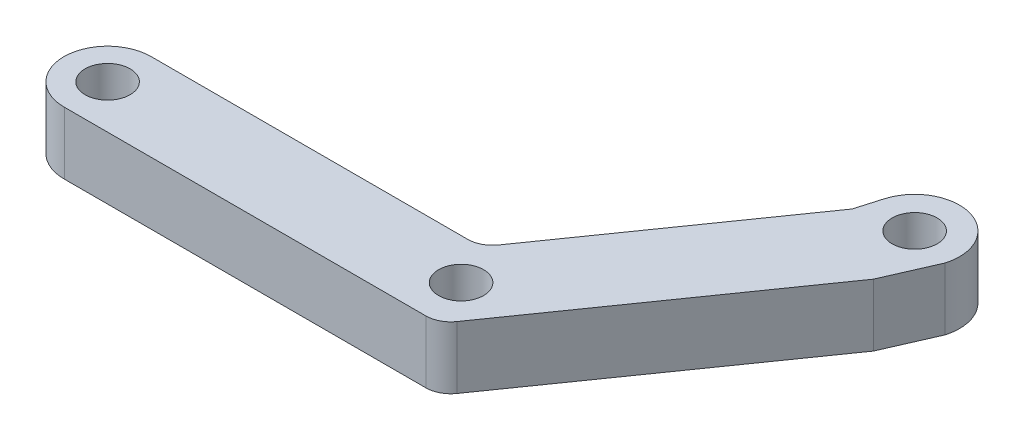
ISO-10303-21;
HEADER;
FILE_DESCRIPTION(('STEP AP214'),'2;1');
FILE_NAME('part.step','',(''),(''),'','','');
FILE_SCHEMA(('AUTOMOTIVE_DESIGN { 1 0 10303 214 1 1 1 1 }'));
ENDSEC;
DATA;
#1=APPLICATION_CONTEXT('core data for automotive mechanical design processes');
#2=APPLICATION_PROTOCOL_DEFINITION('international standard','automotive_design',2000,#1);
#3=PRODUCT_CONTEXT('',#1,'mechanical');
#4=PRODUCT('Part','Part','',(#3));
#5=PRODUCT_RELATED_PRODUCT_CATEGORY('part','',(#4));
#6=PRODUCT_DEFINITION_FORMATION('','',#4);
#7=PRODUCT_DEFINITION_CONTEXT('part definition',#1,'design');
#8=PRODUCT_DEFINITION('design','',#6,#7);
#9=PRODUCT_DEFINITION_SHAPE('','',#8);
#10=(LENGTH_UNIT() NAMED_UNIT(*) SI_UNIT(.MILLI.,.METRE.));
#11=(NAMED_UNIT(*) PLANE_ANGLE_UNIT() SI_UNIT($,.RADIAN.));
#12=(NAMED_UNIT(*) SI_UNIT($,.STERADIAN.) SOLID_ANGLE_UNIT());
#13=UNCERTAINTY_MEASURE_WITH_UNIT(LENGTH_MEASURE(1.E-05),#10,'distance_accuracy_value','');
#14=(GEOMETRIC_REPRESENTATION_CONTEXT(3) GLOBAL_UNCERTAINTY_ASSIGNED_CONTEXT((#13)) GLOBAL_UNIT_ASSIGNED_CONTEXT((#10,
#11,#12)) REPRESENTATION_CONTEXT('',''));
#15=CARTESIAN_POINT('',(0.,0.,0.));
#16=DIRECTION('',(0.,0.,1.));
#17=DIRECTION('',(1.,0.,0.));
#18=AXIS2_PLACEMENT_3D('',#15,#16,#17);
#19=CARTESIAN_POINT('',(0.,6.35,0.));
#20=DIRECTION('',(0.,1.,0.));
#21=DIRECTION('',(0.,0.,1.));
#22=AXIS2_PLACEMENT_3D('',#19,#20,#21);
#23=PLANE('',#22);
#24=CARTESIAN_POINT('',(54.2828781838694,6.35,-27.9654174211772));
#25=DIRECTION('',(0.,1.,0.));
#26=DIRECTION('',(0.,0.,1.));
#27=AXIS2_PLACEMENT_3D('',#24,#25,#26);
#28=CIRCLE('',#27,2.29235);
#29=CARTESIAN_POINT('',(54.2828781838694,6.35,-25.6730674211772));
#30=VERTEX_POINT('',#29);
#31=EDGE_CURVE('E212',#30,#30,#28,.T.);
#32=ORIENTED_EDGE('',*,*,#31,.F.);
#33=EDGE_LOOP('',(#32));
#34=FACE_BOUND('',#33,.T.);
#35=CARTESIAN_POINT('',(0.,6.35,0.));
#36=DIRECTION('',(0.,1.,0.));
#37=DIRECTION('',(0.,0.,1.));
#38=AXIS2_PLACEMENT_3D('',#35,#36,#37);
#39=CIRCLE('',#38,4.4452616227754);
#40=CARTESIAN_POINT('',(0.048227532798311,6.35,-4.445));
#41=VERTEX_POINT('',#40);
#42=CARTESIAN_POINT('',(0.048227532798311,6.35,4.445));
#43=VERTEX_POINT('',#42);
#44=EDGE_CURVE('E161',#41,#43,#39,.T.);
#45=ORIENTED_EDGE('',*,*,#44,.T.);
#46=DIRECTION('',(1.,0.,0.));
#47=VECTOR('',#46,1.);
#48=CARTESIAN_POINT('',(0.048227532798311,6.35,4.445));
#49=LINE('',#48,#47);
#50=CARTESIAN_POINT('',(36.8782275327983,6.35,4.445));
#51=VERTEX_POINT('',#50);
#52=EDGE_CURVE('E99',#43,#51,#49,.T.);
#53=ORIENTED_EDGE('',*,*,#52,.T.);
#54=CARTESIAN_POINT('',(36.8782275327983,6.35,1.90500000000002));
#55=DIRECTION('',(0.,1.,0.));
#56=DIRECTION('',(0.,0.,1.));
#57=AXIS2_PLACEMENT_3D('',#54,#55,#56);
#58=CIRCLE('',#57,2.53999999999998);
#59=CARTESIAN_POINT('',(38.9588737252923,6.35,3.36188414833166));
#60=VERTEX_POINT('',#59);
#61=EDGE_CURVE('E182',#51,#60,#58,.T.);
#62=ORIENTED_EDGE('',*,*,#61,.T.);
#63=DIRECTION('',(0.573576436351044,0.,-0.819152044288993));
#64=VECTOR('',#63,1.);
#65=CARTESIAN_POINT('',(38.9588737252923,6.35,3.36188414833166));
#66=LINE('',#65,#64);
#67=CARTESIAN_POINT('',(56.4414835052722,6.35,-21.6058701615968));
#68=VERTEX_POINT('',#67);
#69=EDGE_CURVE('E201',#60,#68,#66,.T.);
#70=ORIENTED_EDGE('',*,*,#69,.T.);
#71=DIRECTION('',(0.400949598152243,0.,-0.916100114475244));
#72=VECTOR('',#71,1.);
#73=CARTESIAN_POINT('',(56.4414835052722,6.35,-21.6058701615968));
#74=LINE('',#73,#72);
#75=CARTESIAN_POINT('',(58.6648474438086,6.35,-26.6858701615968));
#76=VERTEX_POINT('',#75);
#77=EDGE_CURVE('E198',#68,#76,#74,.T.);
#78=ORIENTED_EDGE('',*,*,#77,.T.);
#79=CARTESIAN_POINT('',(54.2828781838694,6.35,-27.9654174211772));
#80=DIRECTION('',(0.,1.,0.));
#81=DIRECTION('',(0.,0.,-1.));
#82=AXIS2_PLACEMENT_3D('',#79,#80,#81);
#83=CIRCLE('',#82,4.56496394121047);
#84=CARTESIAN_POINT('',(49.9009089239302,6.35,-29.2449646807576));
#85=VERTEX_POINT('',#84);
#86=EDGE_CURVE('E200',#76,#85,#83,.T.);
#87=ORIENTED_EDGE('',*,*,#86,.T.);
#88=DIRECTION('',(-0.280297342116838,0.,0.959913225246031));
#89=VECTOR('',#88,1.);
#90=CARTESIAN_POINT('',(49.159221831543,6.35,-26.7049646807576));
#91=LINE('',#90,#89);
#92=CARTESIAN_POINT('',(49.159221831543,6.35,-26.7049646807576));
#93=VERTEX_POINT('',#92);
#94=EDGE_CURVE('E124',#85,#93,#91,.T.);
#95=ORIENTED_EDGE('',*,*,#94,.T.);
#96=DIRECTION('',(-0.573576436351044,0.,0.819152044288993));
#97=VECTOR('',#96,1.);
#98=CARTESIAN_POINT('',(34.3310326458873,6.35,-5.52811585166835));
#99=LINE('',#98,#97);
#100=CARTESIAN_POINT('',(34.3310326458873,6.35,-5.52811585166835));
#101=VERTEX_POINT('',#100);
#102=EDGE_CURVE('E118',#93,#101,#99,.T.);
#103=ORIENTED_EDGE('',*,*,#102,.T.);
#104=CARTESIAN_POINT('',(32.2503864533933,6.35,-6.985));
#105=DIRECTION('',(0.,-1.,0.));
#106=DIRECTION('',(0.,0.,1.));
#107=AXIS2_PLACEMENT_3D('',#104,#105,#106);
#108=CIRCLE('',#107,2.54);
#109=CARTESIAN_POINT('',(32.2503864533933,6.35,-4.445));
#110=VERTEX_POINT('',#109);
#111=EDGE_CURVE('E122',#101,#110,#108,.T.);
#112=ORIENTED_EDGE('',*,*,#111,.T.);
#113=DIRECTION('',(-1.,0.,0.));
#114=VECTOR('',#113,1.);
#115=CARTESIAN_POINT('',(0.048227532798311,6.35,-4.445));
#116=LINE('',#115,#114);
#117=EDGE_CURVE('E50',#110,#41,#116,.T.);
#118=ORIENTED_EDGE('',*,*,#117,.T.);
#119=EDGE_LOOP('',(#45,#53,#62,#70,#78,#87,#95,#103,#112,#118));
#120=FACE_BOUND('',#119,.T.);
#121=CARTESIAN_POINT('',(35.7371484707128,6.35,-0.286992483727307));
#122=DIRECTION('',(0.,1.,0.));
#123=DIRECTION('',(0.,0.,1.));
#124=AXIS2_PLACEMENT_3D('',#121,#122,#123);
#125=CIRCLE('',#124,2.29235);
#126=CARTESIAN_POINT('',(35.7371484707128,6.35,2.00535751627269));
#127=VERTEX_POINT('',#126);
#128=EDGE_CURVE('E146',#127,#127,#125,.T.);
#129=ORIENTED_EDGE('',*,*,#128,.F.);
#130=EDGE_LOOP('',(#129));
#131=FACE_BOUND('',#130,.T.);
#132=CARTESIAN_POINT('',(0.,6.35,0.));
#133=DIRECTION('',(0.,1.,0.));
#134=DIRECTION('',(0.,0.,1.));
#135=AXIS2_PLACEMENT_3D('',#132,#133,#134);
#136=CIRCLE('',#135,2.29235);
#137=CARTESIAN_POINT('',(0.,6.35,2.29235));
#138=VERTEX_POINT('',#137);
#139=EDGE_CURVE('E218',#138,#138,#136,.T.);
#140=ORIENTED_EDGE('',*,*,#139,.F.);
#141=EDGE_LOOP('',(#140));
#142=FACE_BOUND('',#141,.T.);
#143=ADVANCED_FACE('F33',(#34,#120,#131,#142),#23,.T.);
#144=CARTESIAN_POINT('',(0.,0.,0.));
#145=DIRECTION('',(0.,1.,0.));
#146=DIRECTION('',(0.,0.,1.));
#147=AXIS2_PLACEMENT_3D('',#144,#145,#146);
#148=PLANE('',#147);
#149=CARTESIAN_POINT('',(0.,0.,0.));
#150=DIRECTION('',(0.,1.,0.));
#151=DIRECTION('',(0.,0.,1.));
#152=AXIS2_PLACEMENT_3D('',#149,#150,#151);
#153=CIRCLE('',#152,4.4452616227754);
#154=CARTESIAN_POINT('',(0.048227532798311,0.,-4.445));
#155=VERTEX_POINT('',#154);
#156=CARTESIAN_POINT('',(0.048227532798311,0.,4.445));
#157=VERTEX_POINT('',#156);
#158=EDGE_CURVE('E142',#155,#157,#153,.T.);
#159=ORIENTED_EDGE('',*,*,#158,.F.);
#160=DIRECTION('',(-1.,0.,0.));
#161=VECTOR('',#160,1.);
#162=CARTESIAN_POINT('',(0.048227532798311,0.,-4.445));
#163=LINE('',#162,#161);
#164=CARTESIAN_POINT('',(32.2503864533933,0.,-4.445));
#165=VERTEX_POINT('',#164);
#166=EDGE_CURVE('E91',#165,#155,#163,.T.);
#167=ORIENTED_EDGE('',*,*,#166,.F.);
#168=CARTESIAN_POINT('',(32.2503864533933,0.,-6.985));
#169=DIRECTION('',(0.,-1.,0.));
#170=DIRECTION('',(0.,0.,1.));
#171=AXIS2_PLACEMENT_3D('',#168,#169,#170);
#172=CIRCLE('',#171,2.54);
#173=CARTESIAN_POINT('',(34.3310326458873,0.,-5.52811585166835));
#174=VERTEX_POINT('',#173);
#175=EDGE_CURVE('E85',#174,#165,#172,.T.);
#176=ORIENTED_EDGE('',*,*,#175,.F.);
#177=DIRECTION('',(-0.573576436351044,0.,0.819152044288993));
#178=VECTOR('',#177,1.);
#179=CARTESIAN_POINT('',(34.3310326458873,0.,-5.52811585166835));
#180=LINE('',#179,#178);
#181=CARTESIAN_POINT('',(49.159221831543,0.,-26.7049646807576));
#182=VERTEX_POINT('',#181);
#183=EDGE_CURVE('E132',#182,#174,#180,.T.);
#184=ORIENTED_EDGE('',*,*,#183,.F.);
#185=DIRECTION('',(-0.280297342116838,0.,0.959913225246031));
#186=VECTOR('',#185,1.);
#187=CARTESIAN_POINT('',(49.159221831543,0.,-26.7049646807576));
#188=LINE('',#187,#186);
#189=CARTESIAN_POINT('',(49.9009089239302,0.,-29.2449646807576));
#190=VERTEX_POINT('',#189);
#191=EDGE_CURVE('E156',#190,#182,#188,.T.);
#192=ORIENTED_EDGE('',*,*,#191,.F.);
#193=CARTESIAN_POINT('',(54.2828781838694,0.,-27.9654174211772));
#194=DIRECTION('',(0.,1.,0.));
#195=DIRECTION('',(0.,0.,-1.));
#196=AXIS2_PLACEMENT_3D('',#193,#194,#195);
#197=CIRCLE('',#196,4.56496394121047);
#198=CARTESIAN_POINT('',(58.6648474438086,0.,-26.6858701615968));
#199=VERTEX_POINT('',#198);
#200=EDGE_CURVE('E154',#199,#190,#197,.T.);
#201=ORIENTED_EDGE('',*,*,#200,.F.);
#202=DIRECTION('',(0.400949598152243,0.,-0.916100114475244));
#203=VECTOR('',#202,1.);
#204=CARTESIAN_POINT('',(56.4414835052722,0.,-21.6058701615968));
#205=LINE('',#204,#203);
#206=CARTESIAN_POINT('',(56.4414835052722,0.,-21.6058701615968));
#207=VERTEX_POINT('',#206);
#208=EDGE_CURVE('E152',#207,#199,#205,.T.);
#209=ORIENTED_EDGE('',*,*,#208,.F.);
#210=DIRECTION('',(0.573576436351044,0.,-0.819152044288993));
#211=VECTOR('',#210,1.);
#212=CARTESIAN_POINT('',(38.9588737252923,0.,3.36188414833166));
#213=LINE('',#212,#211);
#214=CARTESIAN_POINT('',(38.9588737252923,0.,3.36188414833166));
#215=VERTEX_POINT('',#214);
#216=EDGE_CURVE('E150',#215,#207,#213,.T.);
#217=ORIENTED_EDGE('',*,*,#216,.F.);
#218=CARTESIAN_POINT('',(36.8782275327983,0.,1.90500000000002));
#219=DIRECTION('',(0.,1.,0.));
#220=DIRECTION('',(0.,0.,1.));
#221=AXIS2_PLACEMENT_3D('',#218,#219,#220);
#222=CIRCLE('',#221,2.53999999999998);
#223=CARTESIAN_POINT('',(36.8782275327983,0.,4.445));
#224=VERTEX_POINT('',#223);
#225=EDGE_CURVE('E148',#224,#215,#222,.T.);
#226=ORIENTED_EDGE('',*,*,#225,.F.);
#227=DIRECTION('',(1.,0.,0.));
#228=VECTOR('',#227,1.);
#229=CARTESIAN_POINT('',(0.048227532798311,0.,4.445));
#230=LINE('',#229,#228);
#231=EDGE_CURVE('E145',#157,#224,#230,.T.);
#232=ORIENTED_EDGE('',*,*,#231,.F.);
#233=EDGE_LOOP('',(#159,#167,#176,#184,#192,#201,#209,#217,#226,#232));
#234=FACE_BOUND('',#233,.T.);
#235=CARTESIAN_POINT('',(35.7371484707128,0.,-0.286992483727307));
#236=DIRECTION('',(0.,1.,0.));
#237=DIRECTION('',(0.,0.,1.));
#238=AXIS2_PLACEMENT_3D('',#235,#236,#237);
#239=CIRCLE('',#238,2.29235);
#240=CARTESIAN_POINT('',(35.7371484707128,0.,2.00535751627269));
#241=VERTEX_POINT('',#240);
#242=EDGE_CURVE('E209',#241,#241,#239,.T.);
#243=ORIENTED_EDGE('',*,*,#242,.T.);
#244=EDGE_LOOP('',(#243));
#245=FACE_BOUND('',#244,.T.);
#246=CARTESIAN_POINT('',(54.2828781838694,0.,-27.9654174211772));
#247=DIRECTION('',(0.,1.,0.));
#248=DIRECTION('',(0.,0.,1.));
#249=AXIS2_PLACEMENT_3D('',#246,#247,#248);
#250=CIRCLE('',#249,2.29235);
#251=CARTESIAN_POINT('',(54.2828781838694,0.,-25.6730674211772));
#252=VERTEX_POINT('',#251);
#253=EDGE_CURVE('E215',#252,#252,#250,.T.);
#254=ORIENTED_EDGE('',*,*,#253,.T.);
#255=EDGE_LOOP('',(#254));
#256=FACE_BOUND('',#255,.T.);
#257=CARTESIAN_POINT('',(0.,0.,0.));
#258=DIRECTION('',(0.,1.,0.));
#259=DIRECTION('',(0.,0.,1.));
#260=AXIS2_PLACEMENT_3D('',#257,#258,#259);
#261=CIRCLE('',#260,2.29235);
#262=CARTESIAN_POINT('',(0.,0.,2.29235));
#263=VERTEX_POINT('',#262);
#264=EDGE_CURVE('E221',#263,#263,#261,.T.);
#265=ORIENTED_EDGE('',*,*,#264,.T.);
#266=EDGE_LOOP('',(#265));
#267=FACE_BOUND('',#266,.T.);
#268=ADVANCED_FACE('F186',(#234,#245,#256,#267),#148,.F.);
#269=CARTESIAN_POINT('',(0.,6.35,0.));
#270=DIRECTION('',(0.,-1.,0.));
#271=DIRECTION('',(0.,0.,-1.));
#272=AXIS2_PLACEMENT_3D('',#269,#270,#271);
#273=CYLINDRICAL_SURFACE('',#272,4.4452616227754);
#274=ORIENTED_EDGE('',*,*,#158,.T.);
#275=DIRECTION('',(0.,-1.,0.));
#276=VECTOR('',#275,1.);
#277=CARTESIAN_POINT('',(0.048227532798311,6.35,4.445));
#278=LINE('',#277,#276);
#279=EDGE_CURVE('E11',#43,#157,#278,.T.);
#280=ORIENTED_EDGE('',*,*,#279,.F.);
#281=ORIENTED_EDGE('',*,*,#44,.F.);
#282=DIRECTION('',(0.,-1.,0.));
#283=VECTOR('',#282,1.);
#284=CARTESIAN_POINT('',(0.048227532798311,6.35,-4.445));
#285=LINE('',#284,#283);
#286=EDGE_CURVE('E138',#41,#155,#285,.T.);
#287=ORIENTED_EDGE('',*,*,#286,.T.);
#288=EDGE_LOOP('',(#274,#280,#281,#287));
#289=FACE_BOUND('',#288,.T.);
#290=ADVANCED_FACE('F35',(#289),#273,.T.);
#291=CARTESIAN_POINT('',(0.048227532798311,6.35,4.445));
#292=DIRECTION('',(0.,0.,-1.));
#293=DIRECTION('',(-1.,0.,0.));
#294=AXIS2_PLACEMENT_3D('',#291,#292,#293);
#295=PLANE('',#294);
#296=ORIENTED_EDGE('',*,*,#231,.T.);
#297=DIRECTION('',(0.,-1.,0.));
#298=VECTOR('',#297,1.);
#299=CARTESIAN_POINT('',(36.8782275327983,6.35,4.445));
#300=LINE('',#299,#298);
#301=EDGE_CURVE('E42',#51,#224,#300,.T.);
#302=ORIENTED_EDGE('',*,*,#301,.F.);
#303=ORIENTED_EDGE('',*,*,#52,.F.);
#304=ORIENTED_EDGE('',*,*,#279,.T.);
#305=EDGE_LOOP('',(#296,#302,#303,#304));
#306=FACE_BOUND('',#305,.T.);
#307=ADVANCED_FACE('F262',(#306),#295,.F.);
#308=CARTESIAN_POINT('',(36.8782275327983,6.35,1.90500000000002));
#309=DIRECTION('',(0.,-1.,0.));
#310=DIRECTION('',(0.,0.,-1.));
#311=AXIS2_PLACEMENT_3D('',#308,#309,#310);
#312=CYLINDRICAL_SURFACE('',#311,2.53999999999998);
#313=ORIENTED_EDGE('',*,*,#225,.T.);
#314=DIRECTION('',(0.,-1.,0.));
#315=VECTOR('',#314,1.);
#316=CARTESIAN_POINT('',(38.9588737252923,6.35,3.36188414833166));
#317=LINE('',#316,#315);
#318=EDGE_CURVE('E174',#60,#215,#317,.T.);
#319=ORIENTED_EDGE('',*,*,#318,.F.);
#320=ORIENTED_EDGE('',*,*,#61,.F.);
#321=ORIENTED_EDGE('',*,*,#301,.T.);
#322=EDGE_LOOP('',(#313,#319,#320,#321));
#323=FACE_BOUND('',#322,.T.);
#324=ADVANCED_FACE('F180',(#323),#312,.T.);
#325=CARTESIAN_POINT('',(38.9588737252923,6.35,3.36188414833166));
#326=DIRECTION('',(-0.819152044288993,0.,-0.573576436351044));
#327=DIRECTION('',(-0.573576436351044,0.,0.819152044288993));
#328=AXIS2_PLACEMENT_3D('',#325,#326,#327);
#329=PLANE('',#328);
#330=ORIENTED_EDGE('',*,*,#216,.T.);
#331=DIRECTION('',(0.,-1.,0.));
#332=VECTOR('',#331,1.);
#333=CARTESIAN_POINT('',(56.4414835052722,6.35,-21.6058701615968));
#334=LINE('',#333,#332);
#335=EDGE_CURVE('E171',#68,#207,#334,.T.);
#336=ORIENTED_EDGE('',*,*,#335,.F.);
#337=ORIENTED_EDGE('',*,*,#69,.F.);
#338=ORIENTED_EDGE('',*,*,#318,.T.);
#339=EDGE_LOOP('',(#330,#336,#337,#338));
#340=FACE_BOUND('',#339,.T.);
#341=ADVANCED_FACE('F192',(#340),#329,.F.);
#342=CARTESIAN_POINT('',(56.4414835052722,6.35,-21.6058701615968));
#343=DIRECTION('',(-0.916100114475244,0.,-0.400949598152243));
#344=DIRECTION('',(-0.400949598152243,0.,0.916100114475244));
#345=AXIS2_PLACEMENT_3D('',#342,#343,#344);
#346=PLANE('',#345);
#347=ORIENTED_EDGE('',*,*,#208,.T.);
#348=DIRECTION('',(0.,-1.,0.));
#349=VECTOR('',#348,1.);
#350=CARTESIAN_POINT('',(58.6648474438086,6.35,-26.6858701615968));
#351=LINE('',#350,#349);
#352=EDGE_CURVE('E168',#76,#199,#351,.T.);
#353=ORIENTED_EDGE('',*,*,#352,.F.);
#354=ORIENTED_EDGE('',*,*,#77,.F.);
#355=ORIENTED_EDGE('',*,*,#335,.T.);
#356=EDGE_LOOP('',(#347,#353,#354,#355));
#357=FACE_BOUND('',#356,.T.);
#358=ADVANCED_FACE('F196',(#357),#346,.F.);
#359=CARTESIAN_POINT('',(54.2828781838694,6.35,-27.9654174211772));
#360=DIRECTION('',(0.,-1.,0.));
#361=DIRECTION('',(0.,0.,-1.));
#362=AXIS2_PLACEMENT_3D('',#359,#360,#361);
#363=CYLINDRICAL_SURFACE('',#362,4.56496394121047);
#364=ORIENTED_EDGE('',*,*,#200,.T.);
#365=DIRECTION('',(0.,-1.,0.));
#366=VECTOR('',#365,1.);
#367=CARTESIAN_POINT('',(49.9009089239302,6.35,-29.2449646807576));
#368=LINE('',#367,#366);
#369=EDGE_CURVE('E165',#85,#190,#368,.T.);
#370=ORIENTED_EDGE('',*,*,#369,.F.);
#371=ORIENTED_EDGE('',*,*,#86,.F.);
#372=ORIENTED_EDGE('',*,*,#352,.T.);
#373=EDGE_LOOP('',(#364,#370,#371,#372));
#374=FACE_BOUND('',#373,.T.);
#375=ADVANCED_FACE('F252',(#374),#363,.T.);
#376=CARTESIAN_POINT('',(49.159221831543,6.35,-26.7049646807576));
#377=DIRECTION('',(0.95991322524603,0.,0.280297342116838));
#378=DIRECTION('',(0.280297342116838,0.,-0.959913225246031));
#379=AXIS2_PLACEMENT_3D('',#376,#377,#378);
#380=PLANE('',#379);
#381=ORIENTED_EDGE('',*,*,#191,.T.);
#382=DIRECTION('',(0.,-1.,0.));
#383=VECTOR('',#382,1.);
#384=CARTESIAN_POINT('',(49.159221831543,6.35,-26.7049646807576));
#385=LINE('',#384,#383);
#386=EDGE_CURVE('E133',#93,#182,#385,.T.);
#387=ORIENTED_EDGE('',*,*,#386,.F.);
#388=ORIENTED_EDGE('',*,*,#94,.F.);
#389=ORIENTED_EDGE('',*,*,#369,.T.);
#390=EDGE_LOOP('',(#381,#387,#388,#389));
#391=FACE_BOUND('',#390,.T.);
#392=ADVANCED_FACE('F249',(#391),#380,.F.);
#393=CARTESIAN_POINT('',(34.3310326458873,6.35,-5.52811585166835));
#394=DIRECTION('',(0.819152044288993,0.,0.573576436351044));
#395=DIRECTION('',(0.573576436351044,0.,-0.819152044288993));
#396=AXIS2_PLACEMENT_3D('',#393,#394,#395);
#397=PLANE('',#396);
#398=ORIENTED_EDGE('',*,*,#183,.T.);
#399=DIRECTION('',(0.,-1.,0.));
#400=VECTOR('',#399,1.);
#401=CARTESIAN_POINT('',(34.3310326458873,6.35,-5.52811585166835));
#402=LINE('',#401,#400);
#403=EDGE_CURVE('E129',#101,#174,#402,.T.);
#404=ORIENTED_EDGE('',*,*,#403,.F.);
#405=ORIENTED_EDGE('',*,*,#102,.F.);
#406=ORIENTED_EDGE('',*,*,#386,.T.);
#407=EDGE_LOOP('',(#398,#404,#405,#406));
#408=FACE_BOUND('',#407,.T.);
#409=ADVANCED_FACE('F130',(#408),#397,.F.);
#410=CARTESIAN_POINT('',(32.2503864533933,6.35,-6.985));
#411=DIRECTION('',(0.,-1.,0.));
#412=DIRECTION('',(0.,0.,-1.));
#413=AXIS2_PLACEMENT_3D('',#410,#411,#412);
#414=CYLINDRICAL_SURFACE('',#413,2.54);
#415=ORIENTED_EDGE('',*,*,#175,.T.);
#416=DIRECTION('',(0.,-1.,0.));
#417=VECTOR('',#416,1.);
#418=CARTESIAN_POINT('',(32.2503864533933,6.35,-4.445));
#419=LINE('',#418,#417);
#420=EDGE_CURVE('E134',#110,#165,#419,.T.);
#421=ORIENTED_EDGE('',*,*,#420,.F.);
#422=ORIENTED_EDGE('',*,*,#111,.F.);
#423=ORIENTED_EDGE('',*,*,#403,.T.);
#424=EDGE_LOOP('',(#415,#421,#422,#423));
#425=FACE_BOUND('',#424,.T.);
#426=ADVANCED_FACE('F136',(#425),#414,.F.);
#427=CARTESIAN_POINT('',(0.048227532798311,6.35,-4.445));
#428=DIRECTION('',(0.,0.,1.));
#429=DIRECTION('',(1.,0.,0.));
#430=AXIS2_PLACEMENT_3D('',#427,#428,#429);
#431=PLANE('',#430);
#432=ORIENTED_EDGE('',*,*,#166,.T.);
#433=ORIENTED_EDGE('',*,*,#286,.F.);
#434=ORIENTED_EDGE('',*,*,#117,.F.);
#435=ORIENTED_EDGE('',*,*,#420,.T.);
#436=EDGE_LOOP('',(#432,#433,#434,#435));
#437=FACE_BOUND('',#436,.T.);
#438=ADVANCED_FACE('F242',(#437),#431,.F.);
#439=CARTESIAN_POINT('',(35.7371484707128,6.35,-0.286992483727307));
#440=DIRECTION('',(0.,-1.,0.));
#441=DIRECTION('',(0.,0.,-1.));
#442=AXIS2_PLACEMENT_3D('',#439,#440,#441);
#443=CYLINDRICAL_SURFACE('',#442,2.29235);
#444=ORIENTED_EDGE('',*,*,#128,.T.);
#445=EDGE_LOOP('',(#444));
#446=FACE_BOUND('',#445,.T.);
#447=ORIENTED_EDGE('',*,*,#242,.F.);
#448=EDGE_LOOP('',(#447));
#449=FACE_BOUND('',#448,.T.);
#450=ADVANCED_FACE('F239',(#446,#449),#443,.F.);
#451=CARTESIAN_POINT('',(54.2828781838694,6.35,-27.9654174211772));
#452=DIRECTION('',(0.,-1.,0.));
#453=DIRECTION('',(0.,0.,-1.));
#454=AXIS2_PLACEMENT_3D('',#451,#452,#453);
#455=CYLINDRICAL_SURFACE('',#454,2.29235);
#456=ORIENTED_EDGE('',*,*,#31,.T.);
#457=EDGE_LOOP('',(#456));
#458=FACE_BOUND('',#457,.T.);
#459=ORIENTED_EDGE('',*,*,#253,.F.);
#460=EDGE_LOOP('',(#459));
#461=FACE_BOUND('',#460,.T.);
#462=ADVANCED_FACE('F338',(#458,#461),#455,.F.);
#463=CARTESIAN_POINT('',(0.,6.35,0.));
#464=DIRECTION('',(0.,-1.,0.));
#465=DIRECTION('',(0.,0.,-1.));
#466=AXIS2_PLACEMENT_3D('',#463,#464,#465);
#467=CYLINDRICAL_SURFACE('',#466,2.29235);
#468=ORIENTED_EDGE('',*,*,#139,.T.);
#469=EDGE_LOOP('',(#468));
#470=FACE_BOUND('',#469,.T.);
#471=ORIENTED_EDGE('',*,*,#264,.F.);
#472=EDGE_LOOP('',(#471));
#473=FACE_BOUND('',#472,.T.);
#474=ADVANCED_FACE('F227',(#470,#473),#467,.F.);
#475=CLOSED_SHELL('',(#143,#268,#290,#307,#324,#341,#358,#375,#392,#409,#426,#438,#450,#462,#474));
#476=MANIFOLD_SOLID_BREP('B2',#475);
#477=ADVANCED_BREP_SHAPE_REPRESENTATION('',(#18,#476),#14);
#478=SHAPE_DEFINITION_REPRESENTATION(#9,#477);
ENDSEC;
END-ISO-10303-21;
